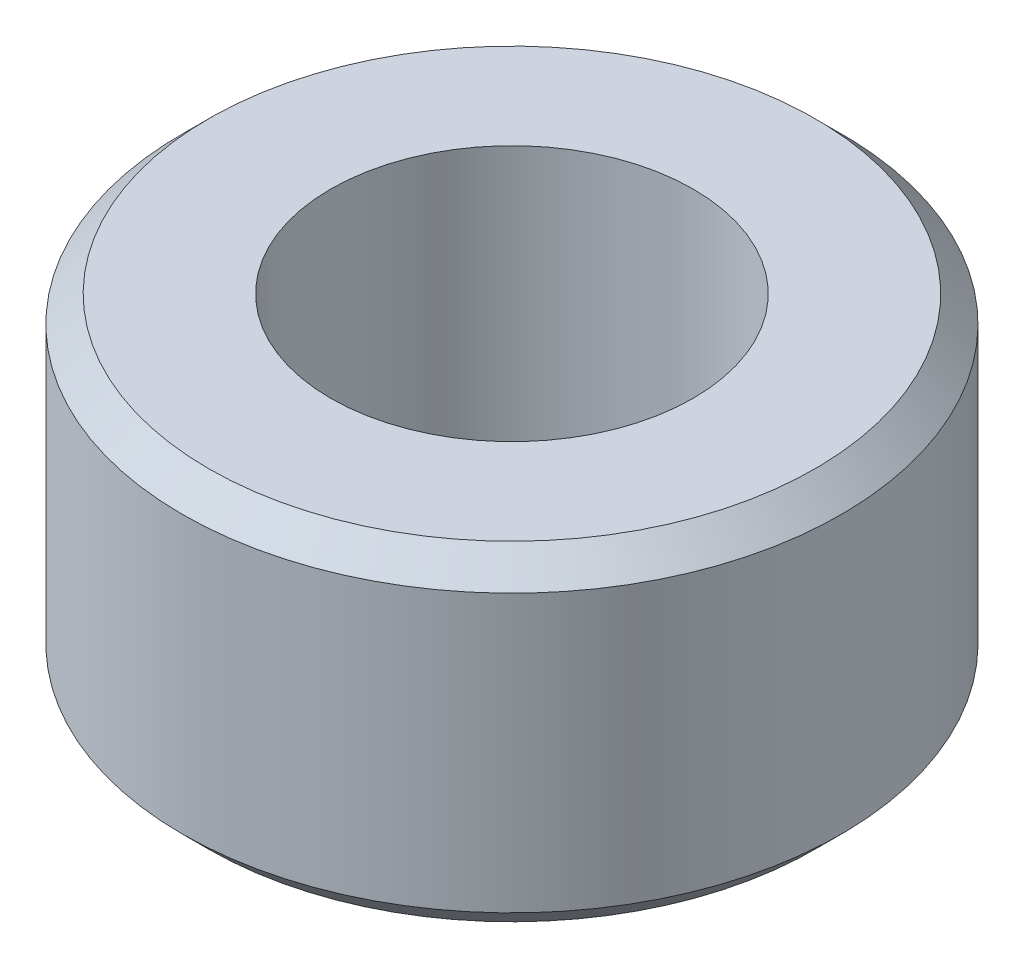
ISO-10303-21;
HEADER;
FILE_DESCRIPTION(('STEP AP214'),'2;1');
FILE_NAME('part.step','',(''),(''),'','','');
FILE_SCHEMA(('AUTOMOTIVE_DESIGN { 1 0 10303 214 1 1 1 1 }'));
ENDSEC;
DATA;
#1=APPLICATION_CONTEXT('core data for automotive mechanical design processes');
#2=APPLICATION_PROTOCOL_DEFINITION('international standard','automotive_design',2000,#1);
#3=PRODUCT_CONTEXT('',#1,'mechanical');
#4=PRODUCT('Part','Part','',(#3));
#5=PRODUCT_RELATED_PRODUCT_CATEGORY('part','',(#4));
#6=PRODUCT_DEFINITION_FORMATION('','',#4);
#7=PRODUCT_DEFINITION_CONTEXT('part definition',#1,'design');
#8=PRODUCT_DEFINITION('design','',#6,#7);
#9=PRODUCT_DEFINITION_SHAPE('','',#8);
#10=(LENGTH_UNIT() NAMED_UNIT(*) SI_UNIT(.MILLI.,.METRE.));
#11=(NAMED_UNIT(*) PLANE_ANGLE_UNIT() SI_UNIT($,.RADIAN.));
#12=(NAMED_UNIT(*) SI_UNIT($,.STERADIAN.) SOLID_ANGLE_UNIT());
#13=UNCERTAINTY_MEASURE_WITH_UNIT(LENGTH_MEASURE(1.E-05),#10,'distance_accuracy_value','');
#14=(GEOMETRIC_REPRESENTATION_CONTEXT(3) GLOBAL_UNCERTAINTY_ASSIGNED_CONTEXT((#13)) GLOBAL_UNIT_ASSIGNED_CONTEXT((#10,
#11,#12)) REPRESENTATION_CONTEXT('',''));
#15=CARTESIAN_POINT('',(0.,0.,0.));
#16=DIRECTION('',(0.,0.,1.));
#17=DIRECTION('',(1.,0.,0.));
#18=AXIS2_PLACEMENT_3D('',#15,#16,#17);
#19=CARTESIAN_POINT('',(0.,2.5,0.));
#20=DIRECTION('',(0.,1.,0.));
#21=DIRECTION('',(0.,0.,1.));
#22=AXIS2_PLACEMENT_3D('',#19,#20,#21);
#23=PLANE('',#22);
#24=CARTESIAN_POINT('',(0.,2.5,0.));
#25=DIRECTION('',(0.,1.,0.));
#26=DIRECTION('',(0.,0.,1.));
#27=AXIS2_PLACEMENT_3D('',#24,#25,#26);
#28=CIRCLE('',#27,4.6);
#29=CARTESIAN_POINT('',(0.,2.5,4.6));
#30=VERTEX_POINT('',#29);
#31=EDGE_CURVE('E10',#30,#30,#28,.T.);
#32=ORIENTED_EDGE('',*,*,#31,.T.);
#33=EDGE_LOOP('',(#32));
#34=FACE_BOUND('',#33,.T.);
#35=CARTESIAN_POINT('',(0.,2.5,0.));
#36=DIRECTION('',(0.,1.,0.));
#37=DIRECTION('',(0.,0.,1.));
#38=AXIS2_PLACEMENT_3D('',#35,#36,#37);
#39=CIRCLE('',#38,2.75);
#40=CARTESIAN_POINT('',(0.,2.5,2.75));
#41=VERTEX_POINT('',#40);
#42=EDGE_CURVE('E58',#41,#41,#39,.T.);
#43=ORIENTED_EDGE('',*,*,#42,.F.);
#44=EDGE_LOOP('',(#43));
#45=FACE_BOUND('',#44,.T.);
#46=ADVANCED_FACE('F37',(#34,#45),#23,.T.);
#47=CARTESIAN_POINT('',(0.,-2.5,0.));
#48=DIRECTION('',(0.,1.,0.));
#49=DIRECTION('',(0.,0.,1.));
#50=AXIS2_PLACEMENT_3D('',#47,#48,#49);
#51=PLANE('',#50);
#52=CARTESIAN_POINT('',(0.,-2.5,0.));
#53=DIRECTION('',(0.,1.,0.));
#54=DIRECTION('',(0.,0.,1.));
#55=AXIS2_PLACEMENT_3D('',#52,#53,#54);
#56=CIRCLE('',#55,4.6);
#57=CARTESIAN_POINT('',(0.,-2.5,4.6));
#58=VERTEX_POINT('',#57);
#59=EDGE_CURVE('E45',#58,#58,#56,.F.);
#60=ORIENTED_EDGE('',*,*,#59,.T.);
#61=EDGE_LOOP('',(#60));
#62=FACE_BOUND('',#61,.T.);
#63=CARTESIAN_POINT('',(0.,-2.5,0.));
#64=DIRECTION('',(0.,1.,0.));
#65=DIRECTION('',(0.,0.,1.));
#66=AXIS2_PLACEMENT_3D('',#63,#64,#65);
#67=CIRCLE('',#66,2.75);
#68=CARTESIAN_POINT('',(0.,-2.5,2.75));
#69=VERTEX_POINT('',#68);
#70=EDGE_CURVE('E59',#69,#69,#67,.T.);
#71=ORIENTED_EDGE('',*,*,#70,.T.);
#72=EDGE_LOOP('',(#71));
#73=FACE_BOUND('',#72,.T.);
#74=ADVANCED_FACE('F69',(#62,#73),#51,.F.);
#75=CARTESIAN_POINT('',(0.,2.5,0.));
#76=DIRECTION('',(0.,-1.,0.));
#77=DIRECTION('',(0.,0.,-1.));
#78=AXIS2_PLACEMENT_3D('',#75,#76,#77);
#79=CYLINDRICAL_SURFACE('',#78,5.);
#80=CARTESIAN_POINT('',(0.,-2.1,0.));
#81=DIRECTION('',(0.,1.,0.));
#82=DIRECTION('',(0.,0.,1.));
#83=AXIS2_PLACEMENT_3D('',#80,#81,#82);
#84=CIRCLE('',#83,5.);
#85=CARTESIAN_POINT('',(0.,-2.1,5.));
#86=VERTEX_POINT('',#85);
#87=EDGE_CURVE('E49',#86,#86,#84,.T.);
#88=ORIENTED_EDGE('',*,*,#87,.T.);
#89=EDGE_LOOP('',(#88));
#90=FACE_BOUND('',#89,.T.);
#91=CARTESIAN_POINT('',(0.,2.1,0.));
#92=DIRECTION('',(0.,1.,0.));
#93=DIRECTION('',(0.,0.,1.));
#94=AXIS2_PLACEMENT_3D('',#91,#92,#93);
#95=CIRCLE('',#94,5.);
#96=CARTESIAN_POINT('',(0.,2.1,5.));
#97=VERTEX_POINT('',#96);
#98=EDGE_CURVE('E53',#97,#97,#95,.F.);
#99=ORIENTED_EDGE('',*,*,#98,.T.);
#100=EDGE_LOOP('',(#99));
#101=FACE_BOUND('',#100,.T.);
#102=ADVANCED_FACE('F74',(#90,#101),#79,.T.);
#103=CARTESIAN_POINT('',(0.,2.5,0.));
#104=DIRECTION('',(0.,-1.,0.));
#105=DIRECTION('',(0.,0.,-1.));
#106=AXIS2_PLACEMENT_3D('',#103,#104,#105);
#107=CYLINDRICAL_SURFACE('',#106,2.75);
#108=ORIENTED_EDGE('',*,*,#42,.T.);
#109=EDGE_LOOP('',(#108));
#110=FACE_BOUND('',#109,.T.);
#111=ORIENTED_EDGE('',*,*,#70,.F.);
#112=EDGE_LOOP('',(#111));
#113=FACE_BOUND('',#112,.T.);
#114=ADVANCED_FACE('F65',(#110,#113),#107,.F.);
#115=CARTESIAN_POINT('',(0.,-2.1,0.));
#116=DIRECTION('',(0.,1.,0.));
#117=DIRECTION('',(0.,0.,1.));
#118=AXIS2_PLACEMENT_3D('',#115,#116,#117);
#119=CONICAL_SURFACE('',#118,5.,0.78539816339745);
#120=ORIENTED_EDGE('',*,*,#59,.F.);
#121=EDGE_LOOP('',(#120));
#122=FACE_BOUND('',#121,.T.);
#123=ORIENTED_EDGE('',*,*,#87,.F.);
#124=EDGE_LOOP('',(#123));
#125=FACE_BOUND('',#124,.T.);
#126=ADVANCED_FACE('F81',(#122,#125),#119,.T.);
#127=CARTESIAN_POINT('',(0.,2.5,0.));
#128=DIRECTION('',(0.,-1.,0.));
#129=DIRECTION('',(0.,0.,-1.));
#130=AXIS2_PLACEMENT_3D('',#127,#128,#129);
#131=CONICAL_SURFACE('',#130,4.6,0.785398163397445);
#132=ORIENTED_EDGE('',*,*,#98,.F.);
#133=EDGE_LOOP('',(#132));
#134=FACE_BOUND('',#133,.T.);
#135=ORIENTED_EDGE('',*,*,#31,.F.);
#136=EDGE_LOOP('',(#135));
#137=FACE_BOUND('',#136,.T.);
#138=ADVANCED_FACE('F40',(#134,#137),#131,.T.);
#139=CLOSED_SHELL('',(#46,#74,#102,#114,#126,#138));
#140=MANIFOLD_SOLID_BREP('B2',#139);
#141=ADVANCED_BREP_SHAPE_REPRESENTATION('',(#18,#140),#14);
#142=SHAPE_DEFINITION_REPRESENTATION(#9,#141);
ENDSEC;
END-ISO-10303-21;
